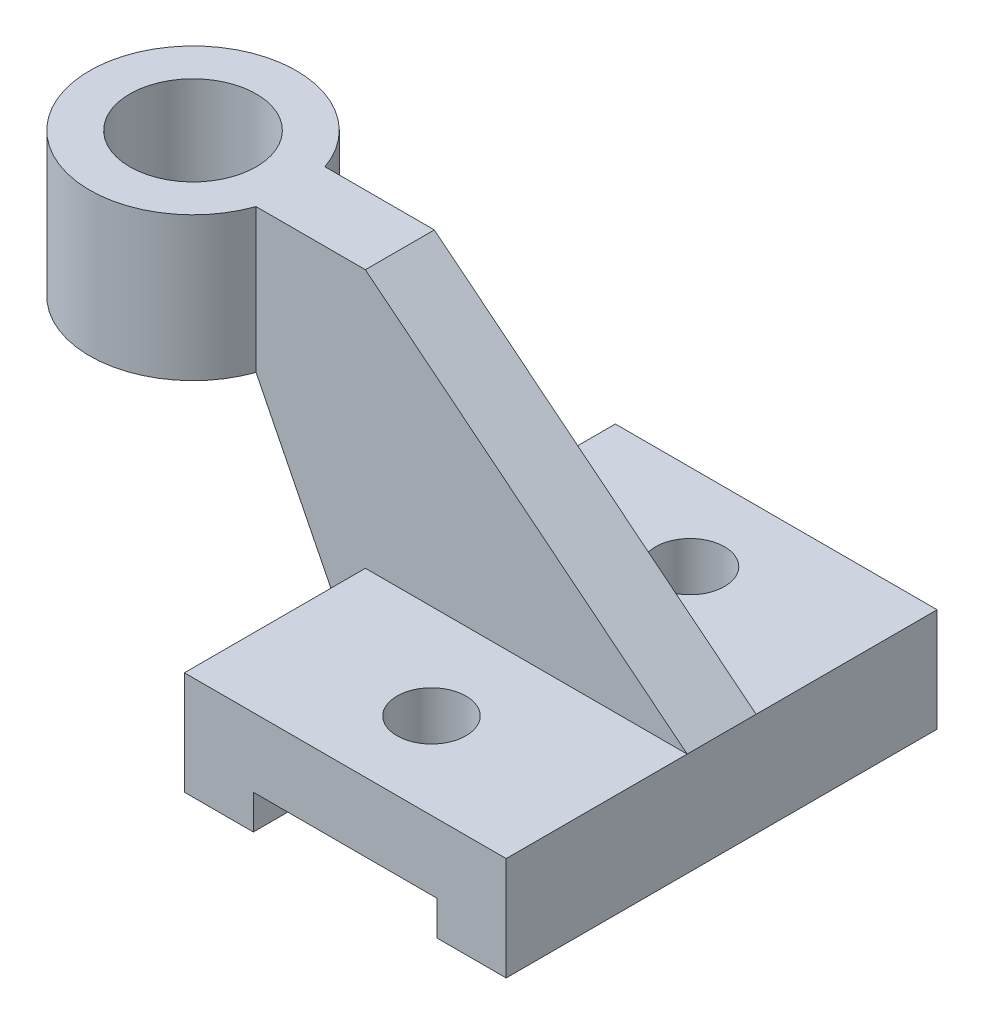
ISO-10303-21;
HEADER;
FILE_DESCRIPTION(('STEP AP214'),'2;1');
FILE_NAME('part.step','',(''),(''),'','','');
FILE_SCHEMA(('AUTOMOTIVE_DESIGN { 1 0 10303 214 1 1 1 1 }'));
ENDSEC;
DATA;
#1=APPLICATION_CONTEXT('core data for automotive mechanical design processes');
#2=APPLICATION_PROTOCOL_DEFINITION('international standard','automotive_design',2000,#1);
#3=PRODUCT_CONTEXT('',#1,'mechanical');
#4=PRODUCT('Part','Part','',(#3));
#5=PRODUCT_RELATED_PRODUCT_CATEGORY('part','',(#4));
#6=PRODUCT_DEFINITION_FORMATION('','',#4);
#7=PRODUCT_DEFINITION_CONTEXT('part definition',#1,'design');
#8=PRODUCT_DEFINITION('design','',#6,#7);
#9=PRODUCT_DEFINITION_SHAPE('','',#8);
#10=(LENGTH_UNIT() NAMED_UNIT(*) SI_UNIT(.MILLI.,.METRE.));
#11=(NAMED_UNIT(*) PLANE_ANGLE_UNIT() SI_UNIT($,.RADIAN.));
#12=(NAMED_UNIT(*) SI_UNIT($,.STERADIAN.) SOLID_ANGLE_UNIT());
#13=UNCERTAINTY_MEASURE_WITH_UNIT(LENGTH_MEASURE(1.E-05),#10,'distance_accuracy_value','');
#14=(GEOMETRIC_REPRESENTATION_CONTEXT(3) GLOBAL_UNCERTAINTY_ASSIGNED_CONTEXT((#13)) GLOBAL_UNIT_ASSIGNED_CONTEXT((#10,
#11,#12)) REPRESENTATION_CONTEXT('',''));
#15=CARTESIAN_POINT('',(0.,0.,0.));
#16=DIRECTION('',(0.,0.,1.));
#17=DIRECTION('',(1.,0.,0.));
#18=AXIS2_PLACEMENT_3D('',#15,#16,#17);
#19=CARTESIAN_POINT('',(0.,18.,0.));
#20=DIRECTION('',(1.,0.,0.));
#21=DIRECTION('',(0.,0.,-1.));
#22=AXIS2_PLACEMENT_3D('',#19,#20,#21);
#23=PLANE('',#22);
#24=DIRECTION('',(0.,-1.,0.));
#25=VECTOR('',#24,1.);
#26=CARTESIAN_POINT('',(0.,0.,-31.5));
#27=LINE('',#26,#25);
#28=CARTESIAN_POINT('',(0.,18.,-31.5));
#29=VERTEX_POINT('',#28);
#30=CARTESIAN_POINT('',(0.,0.,-31.5));
#31=VERTEX_POINT('',#30);
#32=EDGE_CURVE('E176',#29,#31,#27,.T.);
#33=ORIENTED_EDGE('',*,*,#32,.T.);
#34=DIRECTION('',(0.,0.,1.));
#35=VECTOR('',#34,1.);
#36=CARTESIAN_POINT('',(0.,0.,0.));
#37=LINE('',#36,#35);
#38=CARTESIAN_POINT('',(0.,0.,0.));
#39=VERTEX_POINT('',#38);
#40=EDGE_CURVE('E184',#31,#39,#37,.T.);
#41=ORIENTED_EDGE('',*,*,#40,.T.);
#42=DIRECTION('',(0.,-1.,0.));
#43=VECTOR('',#42,1.);
#44=CARTESIAN_POINT('',(0.,18.,0.));
#45=LINE('',#44,#43);
#46=CARTESIAN_POINT('',(0.,18.,0.));
#47=VERTEX_POINT('',#46);
#48=EDGE_CURVE('E12',#47,#39,#45,.T.);
#49=ORIENTED_EDGE('',*,*,#48,.F.);
#50=DIRECTION('',(0.,0.,1.));
#51=VECTOR('',#50,1.);
#52=CARTESIAN_POINT('',(0.,18.,0.));
#53=LINE('',#52,#51);
#54=EDGE_CURVE('E186',#29,#47,#53,.T.);
#55=ORIENTED_EDGE('',*,*,#54,.F.);
#56=EDGE_LOOP('',(#33,#41,#49,#55));
#57=FACE_BOUND('',#56,.T.);
#58=ADVANCED_FACE('F59',(#57),#23,.F.);
#59=CARTESIAN_POINT('',(0.,18.,0.));
#60=DIRECTION('',(0.,-1.,0.));
#61=DIRECTION('',(0.,0.,-1.));
#62=AXIS2_PLACEMENT_3D('',#59,#60,#61);
#63=PLANE('',#62);
#64=CARTESIAN_POINT('',(28.,18.,-15.));
#65=DIRECTION('',(0.,1.,0.));
#66=DIRECTION('',(0.,0.,1.));
#67=AXIS2_PLACEMENT_3D('',#64,#65,#66);
#68=CIRCLE('',#67,5.99999999999999);
#69=CARTESIAN_POINT('',(28.,18.,-9.00000000000001));
#70=VERTEX_POINT('',#69);
#71=EDGE_CURVE('E219',#70,#70,#68,.T.);
#72=ORIENTED_EDGE('',*,*,#71,.F.);
#73=EDGE_LOOP('',(#72));
#74=FACE_BOUND('',#73,.T.);
#75=DIRECTION('',(1.,0.,0.));
#76=VECTOR('',#75,1.);
#77=CARTESIAN_POINT('',(0.,18.,-31.5));
#78=LINE('',#77,#76);
#79=CARTESIAN_POINT('',(56.,18.,-31.5));
#80=VERTEX_POINT('',#79);
#81=EDGE_CURVE('E290',#29,#80,#78,.T.);
#82=ORIENTED_EDGE('',*,*,#81,.F.);
#83=ORIENTED_EDGE('',*,*,#54,.T.);
#84=DIRECTION('',(1.,0.,0.));
#85=VECTOR('',#84,1.);
#86=CARTESIAN_POINT('',(0.,18.,0.));
#87=LINE('',#86,#85);
#88=CARTESIAN_POINT('',(56.,18.,0.));
#89=VERTEX_POINT('',#88);
#90=EDGE_CURVE('E261',#47,#89,#87,.T.);
#91=ORIENTED_EDGE('',*,*,#90,.T.);
#92=DIRECTION('',(0.,0.,-1.));
#93=VECTOR('',#92,1.);
#94=CARTESIAN_POINT('',(56.,18.,0.));
#95=LINE('',#94,#93);
#96=EDGE_CURVE('E263',#89,#80,#95,.T.);
#97=ORIENTED_EDGE('',*,*,#96,.T.);
#98=EDGE_LOOP('',(#82,#83,#91,#97));
#99=FACE_BOUND('',#98,.T.);
#100=ADVANCED_FACE('F348',(#74,#99),#63,.F.);
#101=CARTESIAN_POINT('',(0.,18.,0.));
#102=DIRECTION('',(0.,0.,-1.));
#103=DIRECTION('',(-1.,0.,0.));
#104=AXIS2_PLACEMENT_3D('',#101,#102,#103);
#105=PLANE('',#104);
#106=DIRECTION('',(0.,-1.,0.));
#107=VECTOR('',#106,1.);
#108=CARTESIAN_POINT('',(12.,5.99999999999999,0.));
#109=LINE('',#108,#107);
#110=CARTESIAN_POINT('',(12.,5.99999999999999,0.));
#111=VERTEX_POINT('',#110);
#112=CARTESIAN_POINT('',(12.,0.,0.));
#113=VERTEX_POINT('',#112);
#114=EDGE_CURVE('E194',#111,#113,#109,.T.);
#115=ORIENTED_EDGE('',*,*,#114,.F.);
#116=DIRECTION('',(1.,0.,0.));
#117=VECTOR('',#116,1.);
#118=CARTESIAN_POINT('',(12.,5.99999999999999,0.));
#119=LINE('',#118,#117);
#120=CARTESIAN_POINT('',(44.,5.99999999999999,0.));
#121=VERTEX_POINT('',#120);
#122=EDGE_CURVE('E239',#111,#121,#119,.T.);
#123=ORIENTED_EDGE('',*,*,#122,.T.);
#124=DIRECTION('',(0.,-1.,0.));
#125=VECTOR('',#124,1.);
#126=CARTESIAN_POINT('',(44.,5.99999999999999,0.));
#127=LINE('',#126,#125);
#128=CARTESIAN_POINT('',(44.,0.,0.));
#129=VERTEX_POINT('',#128);
#130=EDGE_CURVE('E197',#121,#129,#127,.T.);
#131=ORIENTED_EDGE('',*,*,#130,.T.);
#132=DIRECTION('',(1.,0.,0.));
#133=VECTOR('',#132,1.);
#134=CARTESIAN_POINT('',(0.,0.,0.));
#135=LINE('',#134,#133);
#136=CARTESIAN_POINT('',(56.,0.,0.));
#137=VERTEX_POINT('',#136);
#138=EDGE_CURVE('E196',#129,#137,#135,.T.);
#139=ORIENTED_EDGE('',*,*,#138,.T.);
#140=DIRECTION('',(0.,-1.,0.));
#141=VECTOR('',#140,1.);
#142=CARTESIAN_POINT('',(56.,18.,0.));
#143=LINE('',#142,#141);
#144=EDGE_CURVE('E68',#89,#137,#143,.T.);
#145=ORIENTED_EDGE('',*,*,#144,.F.);
#146=ORIENTED_EDGE('',*,*,#90,.F.);
#147=ORIENTED_EDGE('',*,*,#48,.T.);
#148=EDGE_CURVE('E192',#39,#113,#135,.T.);
#149=ORIENTED_EDGE('',*,*,#148,.T.);
#150=EDGE_LOOP('',(#115,#123,#131,#139,#145,#146,#147,#149));
#151=FACE_BOUND('',#150,.T.);
#152=ADVANCED_FACE('F352',(#151),#105,.F.);
#153=CARTESIAN_POINT('',(0.,18.,-75.));
#154=DIRECTION('',(0.,0.,1.));
#155=DIRECTION('',(1.,0.,0.));
#156=AXIS2_PLACEMENT_3D('',#153,#154,#155);
#157=PLANE('',#156);
#158=DIRECTION('',(0.,-1.,0.));
#159=VECTOR('',#158,1.);
#160=CARTESIAN_POINT('',(12.,5.99999999999999,-75.));
#161=LINE('',#160,#159);
#162=CARTESIAN_POINT('',(12.,5.99999999999999,-75.));
#163=VERTEX_POINT('',#162);
#164=CARTESIAN_POINT('',(12.,0.,-75.));
#165=VERTEX_POINT('',#164);
#166=EDGE_CURVE('E248',#163,#165,#161,.T.);
#167=ORIENTED_EDGE('',*,*,#166,.T.);
#168=DIRECTION('',(-1.,0.,0.));
#169=VECTOR('',#168,1.);
#170=CARTESIAN_POINT('',(0.,0.,-75.));
#171=LINE('',#170,#169);
#172=CARTESIAN_POINT('',(0.,0.,-75.));
#173=VERTEX_POINT('',#172);
#174=EDGE_CURVE('E206',#165,#173,#171,.T.);
#175=ORIENTED_EDGE('',*,*,#174,.T.);
#176=DIRECTION('',(0.,-1.,0.));
#177=VECTOR('',#176,1.);
#178=CARTESIAN_POINT('',(0.,18.,-75.));
#179=LINE('',#178,#177);
#180=CARTESIAN_POINT('',(0.,18.,-75.));
#181=VERTEX_POINT('',#180);
#182=EDGE_CURVE('E210',#181,#173,#179,.T.);
#183=ORIENTED_EDGE('',*,*,#182,.F.);
#184=DIRECTION('',(-1.,0.,0.));
#185=VECTOR('',#184,1.);
#186=CARTESIAN_POINT('',(0.,18.,-75.));
#187=LINE('',#186,#185);
#188=CARTESIAN_POINT('',(56.,18.,-75.));
#189=VERTEX_POINT('',#188);
#190=EDGE_CURVE('E201',#189,#181,#187,.T.);
#191=ORIENTED_EDGE('',*,*,#190,.F.);
#192=DIRECTION('',(0.,-1.,0.));
#193=VECTOR('',#192,1.);
#194=CARTESIAN_POINT('',(56.,18.,-75.));
#195=LINE('',#194,#193);
#196=CARTESIAN_POINT('',(56.,0.,-75.));
#197=VERTEX_POINT('',#196);
#198=EDGE_CURVE('E213',#189,#197,#195,.T.);
#199=ORIENTED_EDGE('',*,*,#198,.T.);
#200=CARTESIAN_POINT('',(44.,0.,-75.));
#201=VERTEX_POINT('',#200);
#202=EDGE_CURVE('E207',#197,#201,#171,.T.);
#203=ORIENTED_EDGE('',*,*,#202,.T.);
#204=DIRECTION('',(0.,-1.,0.));
#205=VECTOR('',#204,1.);
#206=CARTESIAN_POINT('',(44.,5.99999999999999,-75.));
#207=LINE('',#206,#205);
#208=CARTESIAN_POINT('',(44.,5.99999999999999,-75.));
#209=VERTEX_POINT('',#208);
#210=EDGE_CURVE('E254',#209,#201,#207,.T.);
#211=ORIENTED_EDGE('',*,*,#210,.F.);
#212=DIRECTION('',(-1.,0.,0.));
#213=VECTOR('',#212,1.);
#214=CARTESIAN_POINT('',(44.,5.99999999999999,-75.));
#215=LINE('',#214,#213);
#216=EDGE_CURVE('E245',#209,#163,#215,.T.);
#217=ORIENTED_EDGE('',*,*,#216,.T.);
#218=EDGE_LOOP('',(#167,#175,#183,#191,#199,#203,#211,#217));
#219=FACE_BOUND('',#218,.T.);
#220=ADVANCED_FACE('F281',(#219),#157,.F.);
#221=CARTESIAN_POINT('',(0.,0.,0.));
#222=DIRECTION('',(0.,-1.,0.));
#223=DIRECTION('',(0.,0.,-1.));
#224=AXIS2_PLACEMENT_3D('',#221,#222,#223);
#225=PLANE('',#224);
#226=ORIENTED_EDGE('',*,*,#174,.F.);
#227=DIRECTION('',(0.,0.,1.));
#228=VECTOR('',#227,1.);
#229=CARTESIAN_POINT('',(12.,0.,-75.));
#230=LINE('',#229,#228);
#231=EDGE_CURVE('E223',#165,#113,#230,.T.);
#232=ORIENTED_EDGE('',*,*,#231,.T.);
#233=ORIENTED_EDGE('',*,*,#148,.F.);
#234=ORIENTED_EDGE('',*,*,#40,.F.);
#235=DIRECTION('',(0.,0.,-1.));
#236=VECTOR('',#235,1.);
#237=CARTESIAN_POINT('',(0.,0.,-31.5));
#238=LINE('',#237,#236);
#239=CARTESIAN_POINT('',(0.,0.,-43.5));
#240=VERTEX_POINT('',#239);
#241=EDGE_CURVE('E162',#31,#240,#238,.T.);
#242=ORIENTED_EDGE('',*,*,#241,.T.);
#243=EDGE_CURVE('E193',#173,#240,#37,.T.);
#244=ORIENTED_EDGE('',*,*,#243,.F.);
#245=EDGE_LOOP('',(#226,#232,#233,#234,#242,#244));
#246=FACE_BOUND('',#245,.T.);
#247=ADVANCED_FACE('F189',(#246),#225,.T.);
#248=ORIENTED_EDGE('',*,*,#138,.F.);
#249=DIRECTION('',(0.,0.,-1.));
#250=VECTOR('',#249,1.);
#251=CARTESIAN_POINT('',(44.,0.,0.));
#252=LINE('',#251,#250);
#253=EDGE_CURVE('E240',#129,#201,#252,.T.);
#254=ORIENTED_EDGE('',*,*,#253,.T.);
#255=ORIENTED_EDGE('',*,*,#202,.F.);
#256=DIRECTION('',(0.,0.,-1.));
#257=VECTOR('',#256,1.);
#258=CARTESIAN_POINT('',(56.,0.,0.));
#259=LINE('',#258,#257);
#260=EDGE_CURVE('E204',#137,#197,#259,.T.);
#261=ORIENTED_EDGE('',*,*,#260,.F.);
#262=EDGE_LOOP('',(#248,#254,#255,#261));
#263=FACE_BOUND('',#262,.T.);
#264=ADVANCED_FACE('F356',(#263),#225,.T.);
#265=ORIENTED_EDGE('',*,*,#243,.T.);
#266=DIRECTION('',(0.,-1.,0.));
#267=VECTOR('',#266,1.);
#268=CARTESIAN_POINT('',(0.,0.,-43.5));
#269=LINE('',#268,#267);
#270=CARTESIAN_POINT('',(0.,18.,-43.5));
#271=VERTEX_POINT('',#270);
#272=EDGE_CURVE('E284',#271,#240,#269,.T.);
#273=ORIENTED_EDGE('',*,*,#272,.F.);
#274=EDGE_CURVE('E258',#181,#271,#53,.T.);
#275=ORIENTED_EDGE('',*,*,#274,.F.);
#276=ORIENTED_EDGE('',*,*,#182,.T.);
#277=EDGE_LOOP('',(#265,#273,#275,#276));
#278=FACE_BOUND('',#277,.T.);
#279=ADVANCED_FACE('F61',(#278),#23,.F.);
#280=CARTESIAN_POINT('',(56.,18.,0.));
#281=DIRECTION('',(-1.,0.,0.));
#282=DIRECTION('',(0.,0.,1.));
#283=AXIS2_PLACEMENT_3D('',#280,#281,#282);
#284=PLANE('',#283);
#285=CARTESIAN_POINT('',(56.,18.,-43.5));
#286=VERTEX_POINT('',#285);
#287=EDGE_CURVE('E262',#286,#189,#95,.T.);
#288=ORIENTED_EDGE('',*,*,#287,.F.);
#289=DIRECTION('',(0.,0.,-1.));
#290=VECTOR('',#289,1.);
#291=CARTESIAN_POINT('',(56.,18.,1.5));
#292=LINE('',#291,#290);
#293=EDGE_CURVE('E292',#80,#286,#292,.T.);
#294=ORIENTED_EDGE('',*,*,#293,.F.);
#295=ORIENTED_EDGE('',*,*,#96,.F.);
#296=ORIENTED_EDGE('',*,*,#144,.T.);
#297=ORIENTED_EDGE('',*,*,#260,.T.);
#298=ORIENTED_EDGE('',*,*,#198,.F.);
#299=EDGE_LOOP('',(#288,#294,#295,#296,#297,#298));
#300=FACE_BOUND('',#299,.T.);
#301=ADVANCED_FACE('F277',(#300),#284,.F.);
#302=CARTESIAN_POINT('',(28.,18.,-60.));
#303=DIRECTION('',(0.,1.,0.));
#304=DIRECTION('',(0.,0.,1.));
#305=AXIS2_PLACEMENT_3D('',#302,#303,#304);
#306=CIRCLE('',#305,5.99999999999999);
#307=CARTESIAN_POINT('',(28.,18.,-54.));
#308=VERTEX_POINT('',#307);
#309=EDGE_CURVE('E225',#308,#308,#306,.T.);
#310=ORIENTED_EDGE('',*,*,#309,.F.);
#311=EDGE_LOOP('',(#310));
#312=FACE_BOUND('',#311,.T.);
#313=ORIENTED_EDGE('',*,*,#274,.T.);
#314=DIRECTION('',(1.,0.,0.));
#315=VECTOR('',#314,1.);
#316=CARTESIAN_POINT('',(0.,18.,-43.5));
#317=LINE('',#316,#315);
#318=EDGE_CURVE('E233',#271,#286,#317,.T.);
#319=ORIENTED_EDGE('',*,*,#318,.T.);
#320=ORIENTED_EDGE('',*,*,#287,.T.);
#321=ORIENTED_EDGE('',*,*,#190,.T.);
#322=EDGE_LOOP('',(#313,#319,#320,#321));
#323=FACE_BOUND('',#322,.T.);
#324=ADVANCED_FACE('F271',(#312,#323),#63,.F.);
#325=CARTESIAN_POINT('',(12.,5.99999999999999,-75.));
#326=DIRECTION('',(1.,0.,0.));
#327=DIRECTION('',(0.,0.,-1.));
#328=AXIS2_PLACEMENT_3D('',#325,#326,#327);
#329=PLANE('',#328);
#330=ORIENTED_EDGE('',*,*,#231,.F.);
#331=ORIENTED_EDGE('',*,*,#166,.F.);
#332=DIRECTION('',(0.,0.,1.));
#333=VECTOR('',#332,1.);
#334=CARTESIAN_POINT('',(12.,5.99999999999999,-75.));
#335=LINE('',#334,#333);
#336=EDGE_CURVE('E236',#163,#111,#335,.T.);
#337=ORIENTED_EDGE('',*,*,#336,.T.);
#338=ORIENTED_EDGE('',*,*,#114,.T.);
#339=EDGE_LOOP('',(#330,#331,#337,#338));
#340=FACE_BOUND('',#339,.T.);
#341=ADVANCED_FACE('F377',(#340),#329,.T.);
#342=CARTESIAN_POINT('',(44.,5.99999999999999,0.));
#343=DIRECTION('',(-1.,0.,0.));
#344=DIRECTION('',(0.,0.,1.));
#345=AXIS2_PLACEMENT_3D('',#342,#343,#344);
#346=PLANE('',#345);
#347=ORIENTED_EDGE('',*,*,#253,.F.);
#348=ORIENTED_EDGE('',*,*,#130,.F.);
#349=DIRECTION('',(0.,0.,-1.));
#350=VECTOR('',#349,1.);
#351=CARTESIAN_POINT('',(44.,5.99999999999999,0.));
#352=LINE('',#351,#350);
#353=EDGE_CURVE('E243',#121,#209,#352,.T.);
#354=ORIENTED_EDGE('',*,*,#353,.T.);
#355=ORIENTED_EDGE('',*,*,#210,.T.);
#356=EDGE_LOOP('',(#347,#348,#354,#355));
#357=FACE_BOUND('',#356,.T.);
#358=ADVANCED_FACE('F385',(#357),#346,.T.);
#359=CARTESIAN_POINT('',(0.,5.99999999999999,0.));
#360=DIRECTION('',(0.,1.,0.));
#361=DIRECTION('',(0.,0.,1.));
#362=AXIS2_PLACEMENT_3D('',#359,#360,#361);
#363=PLANE('',#362);
#364=CARTESIAN_POINT('',(28.,5.99999999999999,-15.));
#365=DIRECTION('',(0.,1.,0.));
#366=DIRECTION('',(0.,0.,1.));
#367=AXIS2_PLACEMENT_3D('',#364,#365,#366);
#368=CIRCLE('',#367,5.99999999999999);
#369=CARTESIAN_POINT('',(28.,5.99999999999999,-9.00000000000001));
#370=VERTEX_POINT('',#369);
#371=EDGE_CURVE('E63',#370,#370,#368,.T.);
#372=ORIENTED_EDGE('',*,*,#371,.T.);
#373=EDGE_LOOP('',(#372));
#374=FACE_BOUND('',#373,.T.);
#375=CARTESIAN_POINT('',(28.,5.99999999999999,-60.));
#376=DIRECTION('',(0.,1.,0.));
#377=DIRECTION('',(0.,0.,1.));
#378=AXIS2_PLACEMENT_3D('',#375,#376,#377);
#379=CIRCLE('',#378,5.99999999999999);
#380=CARTESIAN_POINT('',(28.,5.99999999999999,-54.));
#381=VERTEX_POINT('',#380);
#382=EDGE_CURVE('E217',#381,#381,#379,.T.);
#383=ORIENTED_EDGE('',*,*,#382,.T.);
#384=EDGE_LOOP('',(#383));
#385=FACE_BOUND('',#384,.T.);
#386=ORIENTED_EDGE('',*,*,#336,.F.);
#387=ORIENTED_EDGE('',*,*,#216,.F.);
#388=ORIENTED_EDGE('',*,*,#353,.F.);
#389=ORIENTED_EDGE('',*,*,#122,.F.);
#390=EDGE_LOOP('',(#386,#387,#388,#389));
#391=FACE_BOUND('',#390,.T.);
#392=ADVANCED_FACE('F381',(#374,#385,#391),#363,.F.);
#393=CARTESIAN_POINT('',(28.,-29.,-60.));
#394=DIRECTION('',(0.,1.,0.));
#395=DIRECTION('',(0.,0.,1.));
#396=AXIS2_PLACEMENT_3D('',#393,#394,#395);
#397=CYLINDRICAL_SURFACE('',#396,5.99999999999999);
#398=ORIENTED_EDGE('',*,*,#309,.T.);
#399=EDGE_LOOP('',(#398));
#400=FACE_BOUND('',#399,.T.);
#401=ORIENTED_EDGE('',*,*,#382,.F.);
#402=EDGE_LOOP('',(#401));
#403=FACE_BOUND('',#402,.T.);
#404=ADVANCED_FACE('F394',(#400,#403),#397,.F.);
#405=CARTESIAN_POINT('',(28.,-29.,-15.));
#406=DIRECTION('',(0.,1.,0.));
#407=DIRECTION('',(0.,0.,1.));
#408=AXIS2_PLACEMENT_3D('',#405,#406,#407);
#409=CYLINDRICAL_SURFACE('',#408,5.99999999999999);
#410=ORIENTED_EDGE('',*,*,#71,.T.);
#411=EDGE_LOOP('',(#410));
#412=FACE_BOUND('',#411,.T.);
#413=ORIENTED_EDGE('',*,*,#371,.F.);
#414=EDGE_LOOP('',(#413));
#415=FACE_BOUND('',#414,.T.);
#416=ADVANCED_FACE('F400',(#412,#415),#409,.F.);
#417=CARTESIAN_POINT('',(0.,63.,-31.5));
#418=DIRECTION('',(0.,0.,-1.));
#419=DIRECTION('',(-1.,0.,0.));
#420=AXIS2_PLACEMENT_3D('',#417,#418,#419);
#421=PLANE('',#420);
#422=ORIENTED_EDGE('',*,*,#32,.F.);
#423=ORIENTED_EDGE('',*,*,#81,.T.);
#424=DIRECTION('',(-0.779508934793305,0.626391108316048,0.));
#425=VECTOR('',#424,1.);
#426=CARTESIAN_POINT('',(0.,63.,-31.5));
#427=LINE('',#426,#425);
#428=CARTESIAN_POINT('',(0.,63.,-31.5));
#429=VERTEX_POINT('',#428);
#430=EDGE_CURVE('E291',#80,#429,#427,.T.);
#431=ORIENTED_EDGE('',*,*,#430,.T.);
#432=DIRECTION('',(-1.,0.,0.));
#433=VECTOR('',#432,1.);
#434=CARTESIAN_POINT('',(0.,63.,-31.5));
#435=LINE('',#434,#433);
#436=CARTESIAN_POINT('',(-19.0294372515229,63.,-31.5));
#437=VERTEX_POINT('',#436);
#438=EDGE_CURVE('E84',#429,#437,#435,.T.);
#439=ORIENTED_EDGE('',*,*,#438,.T.);
#440=DIRECTION('',(0.,1.,0.));
#441=VECTOR('',#440,1.);
#442=CARTESIAN_POINT('',(-19.0294372515229,38.,-31.5));
#443=LINE('',#442,#441);
#444=CARTESIAN_POINT('',(-19.0294372515229,38.,-31.5));
#445=VERTEX_POINT('',#444);
#446=EDGE_CURVE('E178',#437,#445,#443,.F.);
#447=ORIENTED_EDGE('',*,*,#446,.T.);
#448=DIRECTION('',(-0.447767642663891,0.894149952850875,0.));
#449=VECTOR('',#448,1.);
#450=CARTESIAN_POINT('',(-19.0294372515229,38.,-31.5));
#451=LINE('',#450,#449);
#452=EDGE_CURVE('E165',#31,#445,#451,.T.);
#453=ORIENTED_EDGE('',*,*,#452,.F.);
#454=EDGE_LOOP('',(#422,#423,#431,#439,#447,#453));
#455=FACE_BOUND('',#454,.T.);
#456=ADVANCED_FACE('F174',(#455),#421,.F.);
#457=CARTESIAN_POINT('',(0.,63.,-43.5));
#458=DIRECTION('',(0.,0.,-1.));
#459=DIRECTION('',(-1.,0.,0.));
#460=AXIS2_PLACEMENT_3D('',#457,#458,#459);
#461=PLANE('',#460);
#462=ORIENTED_EDGE('',*,*,#318,.F.);
#463=ORIENTED_EDGE('',*,*,#272,.T.);
#464=DIRECTION('',(-0.447767642663891,0.894149952850875,0.));
#465=VECTOR('',#464,1.);
#466=CARTESIAN_POINT('',(-19.0294372515229,38.,-43.5));
#467=LINE('',#466,#465);
#468=CARTESIAN_POINT('',(-19.0294372515229,38.,-43.5));
#469=VERTEX_POINT('',#468);
#470=EDGE_CURVE('E76',#240,#469,#467,.T.);
#471=ORIENTED_EDGE('',*,*,#470,.T.);
#472=DIRECTION('',(0.,1.,0.));
#473=VECTOR('',#472,1.);
#474=CARTESIAN_POINT('',(-19.0294372515229,38.,-43.5));
#475=LINE('',#474,#473);
#476=CARTESIAN_POINT('',(-19.0294372515229,63.,-43.5));
#477=VERTEX_POINT('',#476);
#478=EDGE_CURVE('E307',#477,#469,#475,.F.);
#479=ORIENTED_EDGE('',*,*,#478,.F.);
#480=DIRECTION('',(-1.,0.,0.));
#481=VECTOR('',#480,1.);
#482=CARTESIAN_POINT('',(0.,63.,-43.5));
#483=LINE('',#482,#481);
#484=CARTESIAN_POINT('',(0.,63.,-43.5));
#485=VERTEX_POINT('',#484);
#486=EDGE_CURVE('E304',#485,#477,#483,.T.);
#487=ORIENTED_EDGE('',*,*,#486,.F.);
#488=DIRECTION('',(-0.779508934793305,0.626391108316048,0.));
#489=VECTOR('',#488,1.);
#490=CARTESIAN_POINT('',(56.,18.,-43.5));
#491=LINE('',#490,#489);
#492=EDGE_CURVE('E289',#286,#485,#491,.T.);
#493=ORIENTED_EDGE('',*,*,#492,.F.);
#494=EDGE_LOOP('',(#462,#463,#471,#479,#487,#493));
#495=FACE_BOUND('',#494,.T.);
#496=ADVANCED_FACE('F286',(#495),#461,.T.);
#497=CARTESIAN_POINT('',(56.,18.,1.5));
#498=DIRECTION('',(-0.626391108316048,-0.779508934793305,0.));
#499=DIRECTION('',(0.779508934793305,-0.626391108316048,0.));
#500=AXIS2_PLACEMENT_3D('',#497,#498,#499);
#501=PLANE('',#500);
#502=ORIENTED_EDGE('',*,*,#293,.T.);
#503=ORIENTED_EDGE('',*,*,#492,.T.);
#504=DIRECTION('',(0.,0.,1.));
#505=VECTOR('',#504,1.);
#506=CARTESIAN_POINT('',(0.,63.,0.));
#507=LINE('',#506,#505);
#508=EDGE_CURVE('E230',#485,#429,#507,.T.);
#509=ORIENTED_EDGE('',*,*,#508,.T.);
#510=ORIENTED_EDGE('',*,*,#430,.F.);
#511=EDGE_LOOP('',(#502,#503,#509,#510));
#512=FACE_BOUND('',#511,.T.);
#513=ADVANCED_FACE('F299',(#512),#501,.F.);
#514=CARTESIAN_POINT('',(0.,38.,-31.5));
#515=DIRECTION('',(0.,-1.,0.));
#516=DIRECTION('',(0.,0.,-1.));
#517=AXIS2_PLACEMENT_3D('',#514,#515,#516);
#518=PLANE('',#517);
#519=DIRECTION('',(0.,0.,-1.));
#520=VECTOR('',#519,1.);
#521=CARTESIAN_POINT('',(-19.0294372515229,38.,-31.5));
#522=LINE('',#521,#520);
#523=EDGE_CURVE('E171',#445,#469,#522,.T.);
#524=ORIENTED_EDGE('',*,*,#523,.F.);
#525=CARTESIAN_POINT('',(-36.,38.,-37.5));
#526=DIRECTION('',(0.,1.,0.));
#527=DIRECTION('',(0.,0.,1.));
#528=AXIS2_PLACEMENT_3D('',#525,#526,#527);
#529=CIRCLE('',#528,18.);
#530=EDGE_CURVE('E313',#469,#445,#529,.T.);
#531=ORIENTED_EDGE('',*,*,#530,.F.);
#532=EDGE_LOOP('',(#524,#531));
#533=FACE_BOUND('',#532,.T.);
#534=CARTESIAN_POINT('',(-36.,38.,-37.5));
#535=DIRECTION('',(0.,1.,0.));
#536=DIRECTION('',(0.,0.,1.));
#537=AXIS2_PLACEMENT_3D('',#534,#535,#536);
#538=CIRCLE('',#537,11.);
#539=CARTESIAN_POINT('',(-36.,38.,-26.5));
#540=VERTEX_POINT('',#539);
#541=EDGE_CURVE('E316',#540,#540,#538,.T.);
#542=ORIENTED_EDGE('',*,*,#541,.T.);
#543=EDGE_LOOP('',(#542));
#544=FACE_BOUND('',#543,.T.);
#545=ADVANCED_FACE('F329',(#533,#544),#518,.T.);
#546=CARTESIAN_POINT('',(0.,63.,-31.5));
#547=DIRECTION('',(0.,-1.,0.));
#548=DIRECTION('',(0.,0.,-1.));
#549=AXIS2_PLACEMENT_3D('',#546,#547,#548);
#550=PLANE('',#549);
#551=CARTESIAN_POINT('',(-36.,63.,-37.5));
#552=DIRECTION('',(0.,1.,0.));
#553=DIRECTION('',(0.,0.,1.));
#554=AXIS2_PLACEMENT_3D('',#551,#552,#553);
#555=CIRCLE('',#554,11.);
#556=CARTESIAN_POINT('',(-36.,63.,-26.5));
#557=VERTEX_POINT('',#556);
#558=EDGE_CURVE('E318',#557,#557,#555,.T.);
#559=ORIENTED_EDGE('',*,*,#558,.F.);
#560=EDGE_LOOP('',(#559));
#561=FACE_BOUND('',#560,.T.);
#562=CARTESIAN_POINT('',(-36.,63.,-37.5));
#563=DIRECTION('',(0.,1.,0.));
#564=DIRECTION('',(0.,0.,1.));
#565=AXIS2_PLACEMENT_3D('',#562,#563,#564);
#566=CIRCLE('',#565,18.);
#567=EDGE_CURVE('E314',#477,#437,#566,.T.);
#568=ORIENTED_EDGE('',*,*,#567,.T.);
#569=ORIENTED_EDGE('',*,*,#438,.F.);
#570=ORIENTED_EDGE('',*,*,#508,.F.);
#571=ORIENTED_EDGE('',*,*,#486,.T.);
#572=EDGE_LOOP('',(#568,#569,#570,#571));
#573=FACE_BOUND('',#572,.T.);
#574=ADVANCED_FACE('F303',(#561,#573),#550,.F.);
#575=CARTESIAN_POINT('',(-36.,38.,-37.5));
#576=DIRECTION('',(0.,1.,0.));
#577=DIRECTION('',(0.,0.,1.));
#578=AXIS2_PLACEMENT_3D('',#575,#576,#577);
#579=CYLINDRICAL_SURFACE('',#578,18.);
#580=ORIENTED_EDGE('',*,*,#446,.F.);
#581=ORIENTED_EDGE('',*,*,#567,.F.);
#582=ORIENTED_EDGE('',*,*,#478,.T.);
#583=ORIENTED_EDGE('',*,*,#530,.T.);
#584=EDGE_LOOP('',(#580,#581,#582,#583));
#585=FACE_BOUND('',#584,.T.);
#586=ADVANCED_FACE('F328',(#585),#579,.T.);
#587=CARTESIAN_POINT('',(-36.,38.,-37.5));
#588=DIRECTION('',(0.,1.,0.));
#589=DIRECTION('',(0.,0.,1.));
#590=AXIS2_PLACEMENT_3D('',#587,#588,#589);
#591=CYLINDRICAL_SURFACE('',#590,11.);
#592=ORIENTED_EDGE('',*,*,#541,.F.);
#593=EDGE_LOOP('',(#592));
#594=FACE_BOUND('',#593,.T.);
#595=ORIENTED_EDGE('',*,*,#558,.T.);
#596=EDGE_LOOP('',(#595));
#597=FACE_BOUND('',#596,.T.);
#598=ADVANCED_FACE('F335',(#594,#597),#591,.F.);
#599=CARTESIAN_POINT('',(-19.0294372515229,38.,-31.5));
#600=DIRECTION('',(-0.894149952850875,-0.447767642663891,0.));
#601=DIRECTION('',(0.447767642663891,-0.894149952850875,0.));
#602=AXIS2_PLACEMENT_3D('',#599,#600,#601);
#603=PLANE('',#602);
#604=ORIENTED_EDGE('',*,*,#470,.F.);
#605=ORIENTED_EDGE('',*,*,#241,.F.);
#606=ORIENTED_EDGE('',*,*,#452,.T.);
#607=ORIENTED_EDGE('',*,*,#523,.T.);
#608=EDGE_LOOP('',(#604,#605,#606,#607));
#609=FACE_BOUND('',#608,.T.);
#610=ADVANCED_FACE('F164',(#609),#603,.T.);
#611=CLOSED_SHELL('',(#58,#100,#152,#220,#247,#264,#279,#301,#324,#341,#358,#392,#404,#416,#456,
#496,#513,#545,#574,#586,#598,#610));
#612=MANIFOLD_SOLID_BREP('B2',#611);
#613=ADVANCED_BREP_SHAPE_REPRESENTATION('',(#18,#612),#14);
#614=SHAPE_DEFINITION_REPRESENTATION(#9,#613);
ENDSEC;
END-ISO-10303-21;
